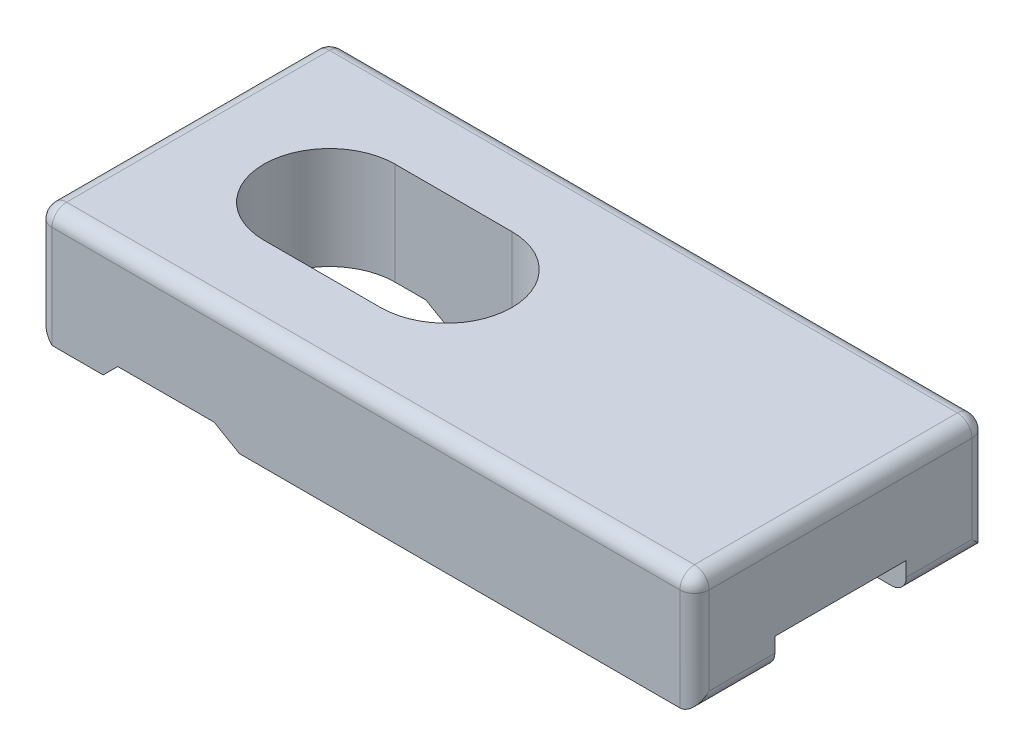
ISO-10303-21;
HEADER;
FILE_DESCRIPTION(('STEP AP214'),'2;1');
FILE_NAME('part.step','',(''),(''),'','','');
FILE_SCHEMA(('AUTOMOTIVE_DESIGN { 1 0 10303 214 1 1 1 1 }'));
ENDSEC;
DATA;
#1=APPLICATION_CONTEXT('core data for automotive mechanical design processes');
#2=APPLICATION_PROTOCOL_DEFINITION('international standard','automotive_design',2000,#1);
#3=PRODUCT_CONTEXT('',#1,'mechanical');
#4=PRODUCT('Part','Part','',(#3));
#5=PRODUCT_RELATED_PRODUCT_CATEGORY('part','',(#4));
#6=PRODUCT_DEFINITION_FORMATION('','',#4);
#7=PRODUCT_DEFINITION_CONTEXT('part definition',#1,'design');
#8=PRODUCT_DEFINITION('design','',#6,#7);
#9=PRODUCT_DEFINITION_SHAPE('','',#8);
#10=(LENGTH_UNIT() NAMED_UNIT(*) SI_UNIT(.MILLI.,.METRE.));
#11=(NAMED_UNIT(*) PLANE_ANGLE_UNIT() SI_UNIT($,.RADIAN.));
#12=(NAMED_UNIT(*) SI_UNIT($,.STERADIAN.) SOLID_ANGLE_UNIT());
#13=UNCERTAINTY_MEASURE_WITH_UNIT(LENGTH_MEASURE(1.E-05),#10,'distance_accuracy_value','');
#14=(GEOMETRIC_REPRESENTATION_CONTEXT(3) GLOBAL_UNCERTAINTY_ASSIGNED_CONTEXT((#13)) GLOBAL_UNIT_ASSIGNED_CONTEXT((#10,
#11,#12)) REPRESENTATION_CONTEXT('',''));
#15=CARTESIAN_POINT('',(0.,0.,0.));
#16=DIRECTION('',(0.,0.,1.));
#17=DIRECTION('',(1.,0.,0.));
#18=AXIS2_PLACEMENT_3D('',#15,#16,#17);
#19=CARTESIAN_POINT('',(0.,0.,0.));
#20=DIRECTION('',(0.,-1.,0.));
#21=DIRECTION('',(0.,0.,-1.));
#22=AXIS2_PLACEMENT_3D('',#19,#20,#21);
#23=PLANE('',#22);
#24=DIRECTION('',(-1.,0.,0.));
#25=VECTOR('',#24,1.);
#26=CARTESIAN_POINT('',(0.,0.,-5.5));
#27=LINE('',#26,#25);
#28=CARTESIAN_POINT('',(4.49999999999999,0.,-5.5));
#29=VERTEX_POINT('',#28);
#30=CARTESIAN_POINT('',(1.00000000000001,0.,-5.5));
#31=VERTEX_POINT('',#30);
#32=EDGE_CURVE('E258',#29,#31,#27,.T.);
#33=ORIENTED_EDGE('',*,*,#32,.F.);
#34=DIRECTION('',(0.,0.,1.));
#35=VECTOR('',#34,1.);
#36=CARTESIAN_POINT('',(4.49999999999999,0.,0.));
#37=LINE('',#36,#35);
#38=CARTESIAN_POINT('',(4.49999999999999,0.,0.));
#39=VERTEX_POINT('',#38);
#40=EDGE_CURVE('E346',#29,#39,#37,.T.);
#41=ORIENTED_EDGE('',*,*,#40,.T.);
#42=DIRECTION('',(1.,0.,0.));
#43=VECTOR('',#42,1.);
#44=CARTESIAN_POINT('',(0.,0.,0.));
#45=LINE('',#44,#43);
#46=CARTESIAN_POINT('',(1.00000000000001,0.,0.));
#47=VERTEX_POINT('',#46);
#48=EDGE_CURVE('E326',#47,#39,#45,.T.);
#49=ORIENTED_EDGE('',*,*,#48,.F.);
#50=DIRECTION('',(0.,0.,-1.));
#51=VECTOR('',#50,1.);
#52=CARTESIAN_POINT('',(1.00000000000001,0.,-5.5));
#53=LINE('',#52,#51);
#54=EDGE_CURVE('E344',#47,#31,#53,.T.);
#55=ORIENTED_EDGE('',*,*,#54,.T.);
#56=EDGE_LOOP('',(#33,#41,#49,#55));
#57=FACE_BOUND('',#56,.T.);
#58=ADVANCED_FACE('F34',(#57),#23,.T.);
#59=DIRECTION('',(-1.,0.,0.));
#60=VECTOR('',#59,1.);
#61=CARTESIAN_POINT('',(0.,0.,-20.));
#62=LINE('',#61,#60);
#63=CARTESIAN_POINT('',(44.,0.,-20.));
#64=VERTEX_POINT('',#63);
#65=CARTESIAN_POINT('',(13.8320508075689,0.,-20.));
#66=VERTEX_POINT('',#65);
#67=EDGE_CURVE('E330',#64,#66,#62,.T.);
#68=ORIENTED_EDGE('',*,*,#67,.F.);
#69=DIRECTION('',(0.,0.,-1.));
#70=VECTOR('',#69,1.);
#71=CARTESIAN_POINT('',(44.,0.,-14.5));
#72=LINE('',#71,#70);
#73=CARTESIAN_POINT('',(44.,0.,-14.5));
#74=VERTEX_POINT('',#73);
#75=EDGE_CURVE('E59',#64,#74,#72,.F.);
#76=ORIENTED_EDGE('',*,*,#75,.T.);
#77=DIRECTION('',(-1.,0.,0.));
#78=VECTOR('',#77,1.);
#79=CARTESIAN_POINT('',(18.,0.,-14.5));
#80=LINE('',#79,#78);
#81=CARTESIAN_POINT('',(13.8320508075689,0.,-14.5));
#82=VERTEX_POINT('',#81);
#83=EDGE_CURVE('E300',#74,#82,#80,.T.);
#84=ORIENTED_EDGE('',*,*,#83,.T.);
#85=DIRECTION('',(0.,0.,-1.));
#86=VECTOR('',#85,1.);
#87=CARTESIAN_POINT('',(13.8320508075689,0.,-20.));
#88=LINE('',#87,#86);
#89=EDGE_CURVE('E353',#82,#66,#88,.T.);
#90=ORIENTED_EDGE('',*,*,#89,.T.);
#91=EDGE_LOOP('',(#68,#76,#84,#90));
#92=FACE_BOUND('',#91,.T.);
#93=ADVANCED_FACE('F554',(#92),#23,.T.);
#94=DIRECTION('',(1.,0.,0.));
#95=VECTOR('',#94,1.);
#96=CARTESIAN_POINT('',(18.,0.,-5.5));
#97=LINE('',#96,#95);
#98=CARTESIAN_POINT('',(13.8320508075689,0.,-5.5));
#99=VERTEX_POINT('',#98);
#100=CARTESIAN_POINT('',(44.,0.,-5.5));
#101=VERTEX_POINT('',#100);
#102=EDGE_CURVE('E304',#99,#101,#97,.T.);
#103=ORIENTED_EDGE('',*,*,#102,.T.);
#104=DIRECTION('',(0.,0.,-1.));
#105=VECTOR('',#104,1.);
#106=CARTESIAN_POINT('',(44.,0.,0.));
#107=LINE('',#106,#105);
#108=CARTESIAN_POINT('',(44.,0.,0.));
#109=VERTEX_POINT('',#108);
#110=EDGE_CURVE('E404',#101,#109,#107,.F.);
#111=ORIENTED_EDGE('',*,*,#110,.T.);
#112=CARTESIAN_POINT('',(13.8320508075689,0.,0.));
#113=VERTEX_POINT('',#112);
#114=EDGE_CURVE('E325',#113,#109,#45,.T.);
#115=ORIENTED_EDGE('',*,*,#114,.F.);
#116=DIRECTION('',(0.,0.,-1.));
#117=VECTOR('',#116,1.);
#118=CARTESIAN_POINT('',(13.8320508075689,0.,-5.5));
#119=LINE('',#118,#117);
#120=EDGE_CURVE('E360',#113,#99,#119,.T.);
#121=ORIENTED_EDGE('',*,*,#120,.T.);
#122=EDGE_LOOP('',(#103,#111,#115,#121));
#123=FACE_BOUND('',#122,.T.);
#124=ADVANCED_FACE('F556',(#123),#23,.T.);
#125=CARTESIAN_POINT('',(9.99999999999999,8.,-10.));
#126=DIRECTION('',(0.,-1.,0.));
#127=DIRECTION('',(0.,0.,-1.));
#128=AXIS2_PLACEMENT_3D('',#125,#126,#127);
#129=CYLINDRICAL_SURFACE('',#128,4.5);
#130=DIRECTION('',(0.,-1.,0.));
#131=VECTOR('',#130,1.);
#132=CARTESIAN_POINT('',(9.99999999999999,8.,-5.5));
#133=LINE('',#132,#131);
#134=CARTESIAN_POINT('',(9.99999999999999,8.,-5.5));
#135=VERTEX_POINT('',#134);
#136=CARTESIAN_POINT('',(9.99999999999999,1.,-5.5));
#137=VERTEX_POINT('',#136);
#138=EDGE_CURVE('E316',#135,#137,#133,.T.);
#139=ORIENTED_EDGE('',*,*,#138,.T.);
#140=CARTESIAN_POINT('',(9.99999999999999,1.,-10.));
#141=DIRECTION('',(0.,-1.,0.));
#142=DIRECTION('',(0.,0.,-1.));
#143=AXIS2_PLACEMENT_3D('',#140,#141,#142);
#144=CIRCLE('',#143,4.5);
#145=CARTESIAN_POINT('',(9.99999999999999,1.,-14.5));
#146=VERTEX_POINT('',#145);
#147=EDGE_CURVE('E278',#137,#146,#144,.T.);
#148=ORIENTED_EDGE('',*,*,#147,.T.);
#149=DIRECTION('',(0.,-1.,0.));
#150=VECTOR('',#149,1.);
#151=CARTESIAN_POINT('',(9.99999999999999,8.,-14.5));
#152=LINE('',#151,#150);
#153=CARTESIAN_POINT('',(9.99999999999999,8.,-14.5));
#154=VERTEX_POINT('',#153);
#155=EDGE_CURVE('E319',#154,#146,#152,.T.);
#156=ORIENTED_EDGE('',*,*,#155,.F.);
#157=CARTESIAN_POINT('',(9.99999999999999,8.,-10.));
#158=DIRECTION('',(0.,1.,0.));
#159=DIRECTION('',(0.,0.,1.));
#160=AXIS2_PLACEMENT_3D('',#157,#158,#159);
#161=CIRCLE('',#160,4.5);
#162=EDGE_CURVE('E306',#154,#135,#161,.T.);
#163=ORIENTED_EDGE('',*,*,#162,.T.);
#164=EDGE_LOOP('',(#139,#148,#156,#163));
#165=FACE_BOUND('',#164,.T.);
#166=ADVANCED_FACE('F478',(#165),#129,.F.);
#167=CARTESIAN_POINT('',(18.,8.,-10.));
#168=DIRECTION('',(0.,-1.,0.));
#169=DIRECTION('',(0.,0.,-1.));
#170=AXIS2_PLACEMENT_3D('',#167,#168,#169);
#171=CYLINDRICAL_SURFACE('',#170,4.5);
#172=DIRECTION('',(0.,-1.,0.));
#173=VECTOR('',#172,1.);
#174=CARTESIAN_POINT('',(18.,8.,-14.5));
#175=LINE('',#174,#173);
#176=CARTESIAN_POINT('',(18.,8.,-14.5));
#177=VERTEX_POINT('',#176);
#178=CARTESIAN_POINT('',(18.,2.,-14.5));
#179=VERTEX_POINT('',#178);
#180=EDGE_CURVE('E322',#177,#179,#175,.T.);
#181=ORIENTED_EDGE('',*,*,#180,.T.);
#182=CARTESIAN_POINT('',(18.,2.,-10.));
#183=DIRECTION('',(0.,-1.,0.));
#184=DIRECTION('',(0.,0.,-1.));
#185=AXIS2_PLACEMENT_3D('',#182,#183,#184);
#186=CIRCLE('',#185,4.5);
#187=CARTESIAN_POINT('',(18.,2.,-5.5));
#188=VERTEX_POINT('',#187);
#189=EDGE_CURVE('E295',#179,#188,#186,.T.);
#190=ORIENTED_EDGE('',*,*,#189,.T.);
#191=DIRECTION('',(0.,-1.,0.));
#192=VECTOR('',#191,1.);
#193=CARTESIAN_POINT('',(18.,8.,-5.5));
#194=LINE('',#193,#192);
#195=CARTESIAN_POINT('',(18.,8.,-5.5));
#196=VERTEX_POINT('',#195);
#197=EDGE_CURVE('E311',#196,#188,#194,.T.);
#198=ORIENTED_EDGE('',*,*,#197,.F.);
#199=CARTESIAN_POINT('',(18.,8.,-10.));
#200=DIRECTION('',(0.,1.,0.));
#201=DIRECTION('',(0.,0.,1.));
#202=AXIS2_PLACEMENT_3D('',#199,#200,#201);
#203=CIRCLE('',#202,4.5);
#204=EDGE_CURVE('E301',#196,#177,#203,.T.);
#205=ORIENTED_EDGE('',*,*,#204,.T.);
#206=EDGE_LOOP('',(#181,#190,#198,#205));
#207=FACE_BOUND('',#206,.T.);
#208=ADVANCED_FACE('F469',(#207),#171,.F.);
#209=CARTESIAN_POINT('',(0.,8.,0.));
#210=DIRECTION('',(0.,-1.,0.));
#211=DIRECTION('',(0.,0.,-1.));
#212=AXIS2_PLACEMENT_3D('',#209,#210,#211);
#213=PLANE('',#212);
#214=DIRECTION('',(-1.,0.,0.));
#215=VECTOR('',#214,1.);
#216=CARTESIAN_POINT('',(0.,8.,-19.));
#217=LINE('',#216,#215);
#218=CARTESIAN_POINT('',(44.,8.,-19.));
#219=VERTEX_POINT('',#218);
#220=CARTESIAN_POINT('',(1.,8.,-19.));
#221=VERTEX_POINT('',#220);
#222=EDGE_CURVE('E368',#219,#221,#217,.T.);
#223=ORIENTED_EDGE('',*,*,#222,.T.);
#224=DIRECTION('',(0.,0.,1.));
#225=VECTOR('',#224,1.);
#226=CARTESIAN_POINT('',(1.,8.,0.));
#227=LINE('',#226,#225);
#228=CARTESIAN_POINT('',(1.,8.,-1.));
#229=VERTEX_POINT('',#228);
#230=EDGE_CURVE('E370',#221,#229,#227,.T.);
#231=ORIENTED_EDGE('',*,*,#230,.T.);
#232=DIRECTION('',(1.,0.,0.));
#233=VECTOR('',#232,1.);
#234=CARTESIAN_POINT('',(0.,8.,-1.));
#235=LINE('',#234,#233);
#236=CARTESIAN_POINT('',(44.,8.,-1.));
#237=VERTEX_POINT('',#236);
#238=EDGE_CURVE('E364',#229,#237,#235,.T.);
#239=ORIENTED_EDGE('',*,*,#238,.T.);
#240=DIRECTION('',(0.,0.,-1.));
#241=VECTOR('',#240,1.);
#242=CARTESIAN_POINT('',(44.,8.,0.));
#243=LINE('',#242,#241);
#244=EDGE_CURVE('E366',#237,#219,#243,.T.);
#245=ORIENTED_EDGE('',*,*,#244,.T.);
#246=EDGE_LOOP('',(#223,#231,#239,#245));
#247=FACE_BOUND('',#246,.T.);
#248=ORIENTED_EDGE('',*,*,#204,.F.);
#249=DIRECTION('',(1.,0.,0.));
#250=VECTOR('',#249,1.);
#251=CARTESIAN_POINT('',(18.,8.,-5.5));
#252=LINE('',#251,#250);
#253=EDGE_CURVE('E309',#135,#196,#252,.T.);
#254=ORIENTED_EDGE('',*,*,#253,.F.);
#255=ORIENTED_EDGE('',*,*,#162,.F.);
#256=DIRECTION('',(-1.,0.,0.));
#257=VECTOR('',#256,1.);
#258=CARTESIAN_POINT('',(18.,8.,-14.5));
#259=LINE('',#258,#257);
#260=EDGE_CURVE('E303',#177,#154,#259,.T.);
#261=ORIENTED_EDGE('',*,*,#260,.F.);
#262=EDGE_LOOP('',(#248,#254,#255,#261));
#263=FACE_BOUND('',#262,.T.);
#264=ADVANCED_FACE('F474',(#247,#263),#213,.F.);
#265=CARTESIAN_POINT('',(4.49999999999999,0.,-20.));
#266=VERTEX_POINT('',#265);
#267=CARTESIAN_POINT('',(1.00000000000001,0.,-20.));
#268=VERTEX_POINT('',#267);
#269=EDGE_CURVE('E329',#266,#268,#62,.T.);
#270=ORIENTED_EDGE('',*,*,#269,.F.);
#271=DIRECTION('',(0.,0.,1.));
#272=VECTOR('',#271,1.);
#273=CARTESIAN_POINT('',(4.49999999999999,0.,-14.5));
#274=LINE('',#273,#272);
#275=CARTESIAN_POINT('',(4.49999999999999,0.,-14.5));
#276=VERTEX_POINT('',#275);
#277=EDGE_CURVE('E242',#266,#276,#274,.T.);
#278=ORIENTED_EDGE('',*,*,#277,.T.);
#279=DIRECTION('',(1.,0.,0.));
#280=VECTOR('',#279,1.);
#281=CARTESIAN_POINT('',(0.,0.,-14.5));
#282=LINE('',#281,#280);
#283=CARTESIAN_POINT('',(1.00000000000001,0.,-14.5));
#284=VERTEX_POINT('',#283);
#285=EDGE_CURVE('E261',#284,#276,#282,.T.);
#286=ORIENTED_EDGE('',*,*,#285,.F.);
#287=DIRECTION('',(0.,0.,-1.));
#288=VECTOR('',#287,1.);
#289=CARTESIAN_POINT('',(1.00000000000001,0.,-20.));
#290=LINE('',#289,#288);
#291=EDGE_CURVE('E237',#284,#268,#290,.T.);
#292=ORIENTED_EDGE('',*,*,#291,.T.);
#293=EDGE_LOOP('',(#270,#278,#286,#292));
#294=FACE_BOUND('',#293,.T.);
#295=ADVANCED_FACE('F542',(#294),#23,.T.);
#296=CARTESIAN_POINT('',(0.,8.,0.));
#297=DIRECTION('',(1.,0.,0.));
#298=DIRECTION('',(0.,0.,-1.));
#299=AXIS2_PLACEMENT_3D('',#296,#297,#298);
#300=PLANE('',#299);
#301=DIRECTION('',(0.,0.,1.));
#302=VECTOR('',#301,1.);
#303=CARTESIAN_POINT('',(0.,7.,0.));
#304=LINE('',#303,#302);
#305=CARTESIAN_POINT('',(0.,7.,-1.));
#306=VERTEX_POINT('',#305);
#307=CARTESIAN_POINT('',(0.,7.,-19.));
#308=VERTEX_POINT('',#307);
#309=EDGE_CURVE('E375',#306,#308,#304,.F.);
#310=ORIENTED_EDGE('',*,*,#309,.T.);
#311=DIRECTION('',(0.,-1.,0.));
#312=VECTOR('',#311,1.);
#313=CARTESIAN_POINT('',(0.,8.,-19.));
#314=LINE('',#313,#312);
#315=CARTESIAN_POINT('',(0.,1.,-19.));
#316=VERTEX_POINT('',#315);
#317=EDGE_CURVE('E226',#308,#316,#314,.T.);
#318=ORIENTED_EDGE('',*,*,#317,.T.);
#319=DIRECTION('',(0.,0.,1.));
#320=VECTOR('',#319,1.);
#321=CARTESIAN_POINT('',(0.,1.,-14.5));
#322=LINE('',#321,#320);
#323=CARTESIAN_POINT('',(0.,1.,-14.5));
#324=VERTEX_POINT('',#323);
#325=EDGE_CURVE('E217',#316,#324,#322,.T.);
#326=ORIENTED_EDGE('',*,*,#325,.T.);
#327=DIRECTION('',(0.,0.,-1.));
#328=VECTOR('',#327,1.);
#329=CARTESIAN_POINT('',(0.,1.,-5.5));
#330=LINE('',#329,#328);
#331=CARTESIAN_POINT('',(0.,1.,-5.5));
#332=VERTEX_POINT('',#331);
#333=EDGE_CURVE('E223',#332,#324,#330,.T.);
#334=ORIENTED_EDGE('',*,*,#333,.F.);
#335=DIRECTION('',(0.,0.,1.));
#336=VECTOR('',#335,1.);
#337=CARTESIAN_POINT('',(0.,1.,0.));
#338=LINE('',#337,#336);
#339=CARTESIAN_POINT('',(0.,1.,-1.));
#340=VERTEX_POINT('',#339);
#341=EDGE_CURVE('E229',#332,#340,#338,.T.);
#342=ORIENTED_EDGE('',*,*,#341,.T.);
#343=DIRECTION('',(0.,-1.,0.));
#344=VECTOR('',#343,1.);
#345=CARTESIAN_POINT('',(0.,8.,-1.));
#346=LINE('',#345,#344);
#347=EDGE_CURVE('E373',#340,#306,#346,.F.);
#348=ORIENTED_EDGE('',*,*,#347,.T.);
#349=EDGE_LOOP('',(#310,#318,#326,#334,#342,#348));
#350=FACE_BOUND('',#349,.T.);
#351=ADVANCED_FACE('F220',(#350),#300,.F.);
#352=CARTESIAN_POINT('',(0.,8.,0.));
#353=DIRECTION('',(0.,0.,-1.));
#354=DIRECTION('',(-1.,0.,0.));
#355=AXIS2_PLACEMENT_3D('',#352,#353,#354);
#356=PLANE('',#355);
#357=ORIENTED_EDGE('',*,*,#114,.T.);
#358=DIRECTION('',(0.,-1.,0.));
#359=VECTOR('',#358,1.);
#360=CARTESIAN_POINT('',(44.,8.,0.));
#361=LINE('',#360,#359);
#362=CARTESIAN_POINT('',(44.,7.,0.));
#363=VERTEX_POINT('',#362);
#364=EDGE_CURVE('E398',#109,#363,#361,.F.);
#365=ORIENTED_EDGE('',*,*,#364,.T.);
#366=DIRECTION('',(1.,0.,0.));
#367=VECTOR('',#366,1.);
#368=CARTESIAN_POINT('',(0.,7.,0.));
#369=LINE('',#368,#367);
#370=CARTESIAN_POINT('',(1.,7.,0.));
#371=VERTEX_POINT('',#370);
#372=EDGE_CURVE('E396',#363,#371,#369,.F.);
#373=ORIENTED_EDGE('',*,*,#372,.T.);
#374=DIRECTION('',(0.,-1.,0.));
#375=VECTOR('',#374,1.);
#376=CARTESIAN_POINT('',(1.,8.,0.));
#377=LINE('',#376,#375);
#378=EDGE_CURVE('E394',#371,#47,#377,.T.);
#379=ORIENTED_EDGE('',*,*,#378,.T.);
#380=ORIENTED_EDGE('',*,*,#48,.T.);
#381=DIRECTION('',(0.70710678118655,0.707106781186545,0.));
#382=VECTOR('',#381,1.);
#383=CARTESIAN_POINT('',(5.5,1.,0.));
#384=LINE('',#383,#382);
#385=CARTESIAN_POINT('',(5.5,1.,0.));
#386=VERTEX_POINT('',#385);
#387=EDGE_CURVE('E230',#39,#386,#384,.T.);
#388=ORIENTED_EDGE('',*,*,#387,.T.);
#389=DIRECTION('',(-1.,0.,0.));
#390=VECTOR('',#389,1.);
#391=CARTESIAN_POINT('',(5.5,1.,0.));
#392=LINE('',#391,#390);
#393=CARTESIAN_POINT('',(12.1,1.,0.));
#394=VERTEX_POINT('',#393);
#395=EDGE_CURVE('E272',#394,#386,#392,.T.);
#396=ORIENTED_EDGE('',*,*,#395,.F.);
#397=DIRECTION('',(0.866025403784438,-0.500000000000002,0.));
#398=VECTOR('',#397,1.);
#399=CARTESIAN_POINT('',(12.1,1.,0.));
#400=LINE('',#399,#398);
#401=EDGE_CURVE('E358',#394,#113,#400,.T.);
#402=ORIENTED_EDGE('',*,*,#401,.T.);
#403=EDGE_LOOP('',(#357,#365,#373,#379,#380,#388,#396,#402));
#404=FACE_BOUND('',#403,.T.);
#405=ADVANCED_FACE('F491',(#404),#356,.F.);
#406=CARTESIAN_POINT('',(45.,8.,0.));
#407=DIRECTION('',(-1.,0.,0.));
#408=DIRECTION('',(0.,0.,1.));
#409=AXIS2_PLACEMENT_3D('',#406,#407,#408);
#410=PLANE('',#409);
#411=DIRECTION('',(0.,-1.,0.));
#412=VECTOR('',#411,1.);
#413=CARTESIAN_POINT('',(45.,8.,-1.));
#414=LINE('',#413,#412);
#415=CARTESIAN_POINT('',(45.,7.,-1.));
#416=VERTEX_POINT('',#415);
#417=CARTESIAN_POINT('',(45.,1.,-1.));
#418=VERTEX_POINT('',#417);
#419=EDGE_CURVE('E390',#416,#418,#414,.T.);
#420=ORIENTED_EDGE('',*,*,#419,.T.);
#421=DIRECTION('',(0.,0.,-1.));
#422=VECTOR('',#421,1.);
#423=CARTESIAN_POINT('',(45.,1.,-5.5));
#424=LINE('',#423,#422);
#425=CARTESIAN_POINT('',(45.,1.,-5.5));
#426=VERTEX_POINT('',#425);
#427=EDGE_CURVE('E392',#418,#426,#424,.T.);
#428=ORIENTED_EDGE('',*,*,#427,.T.);
#429=DIRECTION('',(0.,-1.,0.));
#430=VECTOR('',#429,1.);
#431=CARTESIAN_POINT('',(45.,2.,-5.5));
#432=LINE('',#431,#430);
#433=CARTESIAN_POINT('',(45.,2.,-5.5));
#434=VERTEX_POINT('',#433);
#435=EDGE_CURVE('E293',#434,#426,#432,.T.);
#436=ORIENTED_EDGE('',*,*,#435,.F.);
#437=DIRECTION('',(0.,0.,1.));
#438=VECTOR('',#437,1.);
#439=CARTESIAN_POINT('',(45.,2.,-5.5));
#440=LINE('',#439,#438);
#441=CARTESIAN_POINT('',(45.,2.,-14.5));
#442=VERTEX_POINT('',#441);
#443=EDGE_CURVE('E289',#442,#434,#440,.T.);
#444=ORIENTED_EDGE('',*,*,#443,.F.);
#445=DIRECTION('',(0.,-1.,0.));
#446=VECTOR('',#445,1.);
#447=CARTESIAN_POINT('',(45.,2.,-14.5));
#448=LINE('',#447,#446);
#449=CARTESIAN_POINT('',(45.,1.,-14.5));
#450=VERTEX_POINT('',#449);
#451=EDGE_CURVE('E292',#442,#450,#448,.T.);
#452=ORIENTED_EDGE('',*,*,#451,.T.);
#453=DIRECTION('',(0.,0.,-1.));
#454=VECTOR('',#453,1.);
#455=CARTESIAN_POINT('',(45.,1.,-20.));
#456=LINE('',#455,#454);
#457=CARTESIAN_POINT('',(45.,1.,-19.));
#458=VERTEX_POINT('',#457);
#459=EDGE_CURVE('E386',#450,#458,#456,.T.);
#460=ORIENTED_EDGE('',*,*,#459,.T.);
#461=DIRECTION('',(0.,-1.,0.));
#462=VECTOR('',#461,1.);
#463=CARTESIAN_POINT('',(45.,8.,-19.));
#464=LINE('',#463,#462);
#465=CARTESIAN_POINT('',(45.,7.,-19.));
#466=VERTEX_POINT('',#465);
#467=EDGE_CURVE('E384',#458,#466,#464,.F.);
#468=ORIENTED_EDGE('',*,*,#467,.T.);
#469=DIRECTION('',(0.,0.,-1.));
#470=VECTOR('',#469,1.);
#471=CARTESIAN_POINT('',(45.,7.,0.));
#472=LINE('',#471,#470);
#473=EDGE_CURVE('E388',#466,#416,#472,.F.);
#474=ORIENTED_EDGE('',*,*,#473,.T.);
#475=EDGE_LOOP('',(#420,#428,#436,#444,#452,#460,#468,#474));
#476=FACE_BOUND('',#475,.T.);
#477=ADVANCED_FACE('F462',(#476),#410,.F.);
#478=CARTESIAN_POINT('',(0.,8.,-20.));
#479=DIRECTION('',(0.,0.,1.));
#480=DIRECTION('',(1.,0.,0.));
#481=AXIS2_PLACEMENT_3D('',#478,#479,#480);
#482=PLANE('',#481);
#483=DIRECTION('',(-1.,0.,0.));
#484=VECTOR('',#483,1.);
#485=CARTESIAN_POINT('',(0.,7.,-20.));
#486=LINE('',#485,#484);
#487=CARTESIAN_POINT('',(1.,7.,-20.));
#488=VERTEX_POINT('',#487);
#489=CARTESIAN_POINT('',(44.,7.,-20.));
#490=VERTEX_POINT('',#489);
#491=EDGE_CURVE('E380',#488,#490,#486,.F.);
#492=ORIENTED_EDGE('',*,*,#491,.T.);
#493=DIRECTION('',(0.,-1.,0.));
#494=VECTOR('',#493,1.);
#495=CARTESIAN_POINT('',(44.,8.,-20.));
#496=LINE('',#495,#494);
#497=EDGE_CURVE('E382',#490,#64,#496,.T.);
#498=ORIENTED_EDGE('',*,*,#497,.T.);
#499=ORIENTED_EDGE('',*,*,#67,.T.);
#500=DIRECTION('',(-0.866025403784437,0.500000000000003,0.));
#501=VECTOR('',#500,1.);
#502=CARTESIAN_POINT('',(12.1,1.00000000000001,-20.));
#503=LINE('',#502,#501);
#504=CARTESIAN_POINT('',(12.1,1.,-20.));
#505=VERTEX_POINT('',#504);
#506=EDGE_CURVE('E356',#66,#505,#503,.T.);
#507=ORIENTED_EDGE('',*,*,#506,.T.);
#508=DIRECTION('',(1.,0.,0.));
#509=VECTOR('',#508,1.);
#510=CARTESIAN_POINT('',(5.5,1.,-20.));
#511=LINE('',#510,#509);
#512=CARTESIAN_POINT('',(5.5,1.,-20.));
#513=VERTEX_POINT('',#512);
#514=EDGE_CURVE('E265',#513,#505,#511,.T.);
#515=ORIENTED_EDGE('',*,*,#514,.F.);
#516=DIRECTION('',(-0.70710678118655,-0.707106781186545,0.));
#517=VECTOR('',#516,1.);
#518=CARTESIAN_POINT('',(5.5,1.,-20.));
#519=LINE('',#518,#517);
#520=EDGE_CURVE('E335',#513,#266,#519,.T.);
#521=ORIENTED_EDGE('',*,*,#520,.T.);
#522=ORIENTED_EDGE('',*,*,#269,.T.);
#523=DIRECTION('',(0.,-1.,0.));
#524=VECTOR('',#523,1.);
#525=CARTESIAN_POINT('',(1.,8.,-20.));
#526=LINE('',#525,#524);
#527=EDGE_CURVE('E378',#268,#488,#526,.F.);
#528=ORIENTED_EDGE('',*,*,#527,.T.);
#529=EDGE_LOOP('',(#492,#498,#499,#507,#515,#521,#522,#528));
#530=FACE_BOUND('',#529,.T.);
#531=ADVANCED_FACE('F545',(#530),#482,.F.);
#532=CARTESIAN_POINT('',(18.,8.,-14.5));
#533=DIRECTION('',(0.,0.,1.));
#534=DIRECTION('',(1.,0.,0.));
#535=AXIS2_PLACEMENT_3D('',#532,#533,#534);
#536=PLANE('',#535);
#537=ORIENTED_EDGE('',*,*,#83,.F.);
#538=CARTESIAN_POINT('',(44.,1.,-14.5));
#539=DIRECTION('',(0.,0.,1.));
#540=DIRECTION('',(1.,0.,0.));
#541=AXIS2_PLACEMENT_3D('',#538,#539,#540);
#542=CIRCLE('',#541,1.);
#543=EDGE_CURVE('E401',#74,#450,#542,.T.);
#544=ORIENTED_EDGE('',*,*,#543,.T.);
#545=ORIENTED_EDGE('',*,*,#451,.F.);
#546=DIRECTION('',(1.,0.,0.));
#547=VECTOR('',#546,1.);
#548=CARTESIAN_POINT('',(45.,2.,-14.5));
#549=LINE('',#548,#547);
#550=EDGE_CURVE('E287',#179,#442,#549,.T.);
#551=ORIENTED_EDGE('',*,*,#550,.F.);
#552=ORIENTED_EDGE('',*,*,#180,.F.);
#553=ORIENTED_EDGE('',*,*,#260,.T.);
#554=ORIENTED_EDGE('',*,*,#155,.T.);
#555=DIRECTION('',(1.,0.,0.));
#556=VECTOR('',#555,1.);
#557=CARTESIAN_POINT('',(18.,1.,-14.5));
#558=LINE('',#557,#556);
#559=CARTESIAN_POINT('',(12.1,1.,-14.5));
#560=VERTEX_POINT('',#559);
#561=EDGE_CURVE('E282',#146,#560,#558,.T.);
#562=ORIENTED_EDGE('',*,*,#561,.T.);
#563=DIRECTION('',(0.866025403784437,-0.500000000000003,0.));
#564=VECTOR('',#563,1.);
#565=CARTESIAN_POINT('',(13.4939110867544,0.195225058835923,-14.5));
#566=LINE('',#565,#564);
#567=EDGE_CURVE('E350',#560,#82,#566,.T.);
#568=ORIENTED_EDGE('',*,*,#567,.T.);
#569=EDGE_LOOP('',(#537,#544,#545,#551,#552,#553,#554,#562,#568));
#570=FACE_BOUND('',#569,.T.);
#571=ADVANCED_FACE('F458',(#570),#536,.T.);
#572=CARTESIAN_POINT('',(18.,8.,-5.5));
#573=DIRECTION('',(0.,0.,-1.));
#574=DIRECTION('',(-1.,0.,0.));
#575=AXIS2_PLACEMENT_3D('',#572,#573,#574);
#576=PLANE('',#575);
#577=ORIENTED_EDGE('',*,*,#435,.T.);
#578=CARTESIAN_POINT('',(44.,1.,-5.5));
#579=DIRECTION('',(0.,0.,-1.));
#580=DIRECTION('',(-1.,0.,0.));
#581=AXIS2_PLACEMENT_3D('',#578,#579,#580);
#582=CIRCLE('',#581,1.);
#583=EDGE_CURVE('E51',#426,#101,#582,.T.);
#584=ORIENTED_EDGE('',*,*,#583,.T.);
#585=ORIENTED_EDGE('',*,*,#102,.F.);
#586=DIRECTION('',(-0.866025403784438,0.500000000000002,0.));
#587=VECTOR('',#586,1.);
#588=CARTESIAN_POINT('',(13.4939110867544,0.195225058835913,-5.5));
#589=LINE('',#588,#587);
#590=CARTESIAN_POINT('',(12.1,1.,-5.5));
#591=VERTEX_POINT('',#590);
#592=EDGE_CURVE('E362',#99,#591,#589,.T.);
#593=ORIENTED_EDGE('',*,*,#592,.T.);
#594=DIRECTION('',(-1.,0.,0.));
#595=VECTOR('',#594,1.);
#596=CARTESIAN_POINT('',(18.,1.,-5.5));
#597=LINE('',#596,#595);
#598=EDGE_CURVE('E332',#591,#137,#597,.T.);
#599=ORIENTED_EDGE('',*,*,#598,.T.);
#600=ORIENTED_EDGE('',*,*,#138,.F.);
#601=ORIENTED_EDGE('',*,*,#253,.T.);
#602=ORIENTED_EDGE('',*,*,#197,.T.);
#603=DIRECTION('',(-1.,0.,0.));
#604=VECTOR('',#603,1.);
#605=CARTESIAN_POINT('',(9.99999999999999,2.,-5.5));
#606=LINE('',#605,#604);
#607=EDGE_CURVE('E285',#434,#188,#606,.T.);
#608=ORIENTED_EDGE('',*,*,#607,.F.);
#609=EDGE_LOOP('',(#577,#584,#585,#593,#599,#600,#601,#602,#608));
#610=FACE_BOUND('',#609,.T.);
#611=ADVANCED_FACE('F482',(#610),#576,.T.);
#612=CARTESIAN_POINT('',(9.99999999999999,2.,-10.));
#613=DIRECTION('',(0.,-1.,0.));
#614=DIRECTION('',(0.,0.,-1.));
#615=AXIS2_PLACEMENT_3D('',#612,#613,#614);
#616=PLANE('',#615);
#617=ORIENTED_EDGE('',*,*,#550,.T.);
#618=ORIENTED_EDGE('',*,*,#443,.T.);
#619=ORIENTED_EDGE('',*,*,#607,.T.);
#620=ORIENTED_EDGE('',*,*,#189,.F.);
#621=EDGE_LOOP('',(#617,#618,#619,#620));
#622=FACE_BOUND('',#621,.T.);
#623=ADVANCED_FACE('F465',(#622),#616,.T.);
#624=CARTESIAN_POINT('',(0.,1.,-5.5));
#625=DIRECTION('',(0.,0.,1.));
#626=DIRECTION('',(1.,0.,0.));
#627=AXIS2_PLACEMENT_3D('',#624,#625,#626);
#628=PLANE('',#627);
#629=DIRECTION('',(-1.,0.,0.));
#630=VECTOR('',#629,1.);
#631=CARTESIAN_POINT('',(0.,1.,-5.5));
#632=LINE('',#631,#630);
#633=CARTESIAN_POINT('',(5.5,1.,-5.5));
#634=VERTEX_POINT('',#633);
#635=EDGE_CURVE('E257',#634,#332,#632,.T.);
#636=ORIENTED_EDGE('',*,*,#635,.F.);
#637=DIRECTION('',(-0.70710678118655,-0.707106781186545,0.));
#638=VECTOR('',#637,1.);
#639=CARTESIAN_POINT('',(5.5,1.,-5.5));
#640=LINE('',#639,#638);
#641=EDGE_CURVE('E342',#634,#29,#640,.T.);
#642=ORIENTED_EDGE('',*,*,#641,.T.);
#643=ORIENTED_EDGE('',*,*,#32,.T.);
#644=DIRECTION('',(-0.70710678118655,0.707106781186545,0.));
#645=VECTOR('',#644,1.);
#646=CARTESIAN_POINT('',(0.,1.,-5.5));
#647=LINE('',#646,#645);
#648=EDGE_CURVE('E340',#31,#332,#647,.T.);
#649=ORIENTED_EDGE('',*,*,#648,.T.);
#650=EDGE_LOOP('',(#636,#642,#643,#649));
#651=FACE_BOUND('',#650,.T.);
#652=ADVANCED_FACE('F499',(#651),#628,.F.);
#653=CARTESIAN_POINT('',(0.,1.,-14.5));
#654=DIRECTION('',(0.,0.,-1.));
#655=DIRECTION('',(-1.,0.,0.));
#656=AXIS2_PLACEMENT_3D('',#653,#654,#655);
#657=PLANE('',#656);
#658=ORIENTED_EDGE('',*,*,#285,.T.);
#659=DIRECTION('',(0.70710678118655,0.707106781186545,0.));
#660=VECTOR('',#659,1.);
#661=CARTESIAN_POINT('',(5.5,1.,-14.5));
#662=LINE('',#661,#660);
#663=CARTESIAN_POINT('',(5.5,1.,-14.5));
#664=VERTEX_POINT('',#663);
#665=EDGE_CURVE('E241',#276,#664,#662,.T.);
#666=ORIENTED_EDGE('',*,*,#665,.T.);
#667=DIRECTION('',(1.,0.,0.));
#668=VECTOR('',#667,1.);
#669=CARTESIAN_POINT('',(0.,1.,-14.5));
#670=LINE('',#669,#668);
#671=EDGE_CURVE('E245',#324,#664,#670,.T.);
#672=ORIENTED_EDGE('',*,*,#671,.F.);
#673=DIRECTION('',(0.70710678118655,-0.707106781186545,0.));
#674=VECTOR('',#673,1.);
#675=CARTESIAN_POINT('',(0.,1.,-14.5));
#676=LINE('',#675,#674);
#677=EDGE_CURVE('E233',#324,#284,#676,.T.);
#678=ORIENTED_EDGE('',*,*,#677,.T.);
#679=EDGE_LOOP('',(#658,#666,#672,#678));
#680=FACE_BOUND('',#679,.T.);
#681=ADVANCED_FACE('F246',(#680),#657,.F.);
#682=CARTESIAN_POINT('',(0.,1.,0.));
#683=DIRECTION('',(0.,-1.,0.));
#684=DIRECTION('',(0.,0.,-1.));
#685=AXIS2_PLACEMENT_3D('',#682,#683,#684);
#686=PLANE('',#685);
#687=ORIENTED_EDGE('',*,*,#147,.F.);
#688=ORIENTED_EDGE('',*,*,#598,.F.);
#689=DIRECTION('',(0.,0.,1.));
#690=VECTOR('',#689,1.);
#691=CARTESIAN_POINT('',(12.1,1.,0.));
#692=LINE('',#691,#690);
#693=EDGE_CURVE('E268',#591,#394,#692,.T.);
#694=ORIENTED_EDGE('',*,*,#693,.T.);
#695=ORIENTED_EDGE('',*,*,#395,.T.);
#696=DIRECTION('',(0.,0.,-1.));
#697=VECTOR('',#696,1.);
#698=CARTESIAN_POINT('',(5.5,1.,0.));
#699=LINE('',#698,#697);
#700=EDGE_CURVE('E275',#386,#634,#699,.T.);
#701=ORIENTED_EDGE('',*,*,#700,.T.);
#702=ORIENTED_EDGE('',*,*,#635,.T.);
#703=ORIENTED_EDGE('',*,*,#333,.T.);
#704=ORIENTED_EDGE('',*,*,#671,.T.);
#705=DIRECTION('',(0.,0.,-1.));
#706=VECTOR('',#705,1.);
#707=CARTESIAN_POINT('',(5.5,1.,-14.5));
#708=LINE('',#707,#706);
#709=EDGE_CURVE('E251',#664,#513,#708,.T.);
#710=ORIENTED_EDGE('',*,*,#709,.T.);
#711=ORIENTED_EDGE('',*,*,#514,.T.);
#712=EDGE_CURVE('E269',#505,#560,#692,.T.);
#713=ORIENTED_EDGE('',*,*,#712,.T.);
#714=ORIENTED_EDGE('',*,*,#561,.F.);
#715=EDGE_LOOP('',(#687,#688,#694,#695,#701,#702,#703,#704,#710,#711,#713,#714));
#716=FACE_BOUND('',#715,.T.);
#717=ADVANCED_FACE('F254',(#716),#686,.T.);
#718=CARTESIAN_POINT('',(5.5,1.,-14.5));
#719=DIRECTION('',(0.707106781186545,-0.70710678118655,0.));
#720=DIRECTION('',(0.,0.,1.));
#721=AXIS2_PLACEMENT_3D('',#718,#719,#720);
#722=PLANE('',#721);
#723=ORIENTED_EDGE('',*,*,#665,.F.);
#724=ORIENTED_EDGE('',*,*,#277,.F.);
#725=ORIENTED_EDGE('',*,*,#520,.F.);
#726=ORIENTED_EDGE('',*,*,#709,.F.);
#727=EDGE_LOOP('',(#723,#724,#725,#726));
#728=FACE_BOUND('',#727,.T.);
#729=ADVANCED_FACE('F548',(#728),#722,.T.);
#730=CARTESIAN_POINT('',(5.5,1.,0.));
#731=DIRECTION('',(0.707106781186545,-0.70710678118655,0.));
#732=DIRECTION('',(0.,0.,1.));
#733=AXIS2_PLACEMENT_3D('',#730,#731,#732);
#734=PLANE('',#733);
#735=ORIENTED_EDGE('',*,*,#387,.F.);
#736=ORIENTED_EDGE('',*,*,#40,.F.);
#737=ORIENTED_EDGE('',*,*,#641,.F.);
#738=ORIENTED_EDGE('',*,*,#700,.F.);
#739=EDGE_LOOP('',(#735,#736,#737,#738));
#740=FACE_BOUND('',#739,.T.);
#741=ADVANCED_FACE('F497',(#740),#734,.T.);
#742=CARTESIAN_POINT('',(0.,1.,0.));
#743=DIRECTION('',(-0.707106781186545,-0.70710678118655,0.));
#744=DIRECTION('',(0.,0.,-1.));
#745=AXIS2_PLACEMENT_3D('',#742,#743,#744);
#746=PLANE('',#745);
#747=ORIENTED_EDGE('',*,*,#54,.F.);
#748=CARTESIAN_POINT('',(1.,0.,-1.));
#749=DIRECTION('',(-0.707106781186545,-0.70710678118655,0.));
#750=DIRECTION('',(0.70710678118655,-0.707106781186545,0.));
#751=AXIS2_PLACEMENT_3D('',#748,#749,#750);
#752=ELLIPSE('',#751,1.41421356237309,1.);
#753=EDGE_CURVE('E11',#47,#340,#752,.T.);
#754=ORIENTED_EDGE('',*,*,#753,.T.);
#755=ORIENTED_EDGE('',*,*,#341,.F.);
#756=ORIENTED_EDGE('',*,*,#648,.F.);
#757=EDGE_LOOP('',(#747,#754,#755,#756));
#758=FACE_BOUND('',#757,.T.);
#759=ADVANCED_FACE('F504',(#758),#746,.T.);
#760=CARTESIAN_POINT('',(0.,1.,0.));
#761=DIRECTION('',(-0.707106781186545,-0.70710678118655,0.));
#762=DIRECTION('',(0.,0.,-1.));
#763=AXIS2_PLACEMENT_3D('',#760,#761,#762);
#764=PLANE('',#763);
#765=ORIENTED_EDGE('',*,*,#325,.F.);
#766=CARTESIAN_POINT('',(1.,0.,-19.));
#767=DIRECTION('',(-0.707106781186545,-0.70710678118655,0.));
#768=DIRECTION('',(0.70710678118655,-0.707106781186545,0.));
#769=AXIS2_PLACEMENT_3D('',#766,#767,#768);
#770=ELLIPSE('',#769,1.41421356237309,1.);
#771=EDGE_CURVE('E43',#316,#268,#770,.T.);
#772=ORIENTED_EDGE('',*,*,#771,.T.);
#773=ORIENTED_EDGE('',*,*,#291,.F.);
#774=ORIENTED_EDGE('',*,*,#677,.F.);
#775=EDGE_LOOP('',(#765,#772,#773,#774));
#776=FACE_BOUND('',#775,.T.);
#777=ADVANCED_FACE('F235',(#776),#764,.T.);
#778=CARTESIAN_POINT('',(12.1,1.00000000000001,0.));
#779=DIRECTION('',(-0.500000000000003,-0.866025403784437,0.));
#780=DIRECTION('',(0.,0.,-1.));
#781=AXIS2_PLACEMENT_3D('',#778,#779,#780);
#782=PLANE('',#781);
#783=ORIENTED_EDGE('',*,*,#506,.F.);
#784=ORIENTED_EDGE('',*,*,#89,.F.);
#785=ORIENTED_EDGE('',*,*,#567,.F.);
#786=ORIENTED_EDGE('',*,*,#712,.F.);
#787=EDGE_LOOP('',(#783,#784,#785,#786));
#788=FACE_BOUND('',#787,.T.);
#789=ADVANCED_FACE('F552',(#788),#782,.T.);
#790=CARTESIAN_POINT('',(12.1,1.,0.));
#791=DIRECTION('',(-0.500000000000002,-0.866025403784438,0.));
#792=DIRECTION('',(0.,0.,-1.));
#793=AXIS2_PLACEMENT_3D('',#790,#791,#792);
#794=PLANE('',#793);
#795=ORIENTED_EDGE('',*,*,#592,.F.);
#796=ORIENTED_EDGE('',*,*,#120,.F.);
#797=ORIENTED_EDGE('',*,*,#401,.F.);
#798=ORIENTED_EDGE('',*,*,#693,.F.);
#799=EDGE_LOOP('',(#795,#796,#797,#798));
#800=FACE_BOUND('',#799,.T.);
#801=ADVANCED_FACE('F486',(#800),#794,.T.);
#802=CARTESIAN_POINT('',(44.,1.,0.));
#803=DIRECTION('',(0.,0.,1.));
#804=DIRECTION('',(1.,0.,0.));
#805=AXIS2_PLACEMENT_3D('',#802,#803,#804);
#806=CYLINDRICAL_SURFACE('',#805,1.);
#807=ORIENTED_EDGE('',*,*,#543,.F.);
#808=ORIENTED_EDGE('',*,*,#75,.F.);
#809=CARTESIAN_POINT('',(44.,1.,-19.));
#810=DIRECTION('',(0.,-0.707106781186547,0.707106781186547));
#811=DIRECTION('',(0.,-0.707106781186547,-0.707106781186547));
#812=AXIS2_PLACEMENT_3D('',#809,#810,#811);
#813=ELLIPSE('',#812,1.41421356237309,1.);
#814=EDGE_CURVE('E38',#458,#64,#813,.F.);
#815=ORIENTED_EDGE('',*,*,#814,.F.);
#816=ORIENTED_EDGE('',*,*,#459,.F.);
#817=EDGE_LOOP('',(#807,#808,#815,#816));
#818=FACE_BOUND('',#817,.T.);
#819=ADVANCED_FACE('F36',(#818),#806,.T.);
#820=CARTESIAN_POINT('',(44.,1.,0.));
#821=DIRECTION('',(0.,0.,1.));
#822=DIRECTION('',(1.,0.,0.));
#823=AXIS2_PLACEMENT_3D('',#820,#821,#822);
#824=CYLINDRICAL_SURFACE('',#823,1.);
#825=ORIENTED_EDGE('',*,*,#583,.F.);
#826=ORIENTED_EDGE('',*,*,#427,.F.);
#827=CARTESIAN_POINT('',(44.,1.,-1.));
#828=DIRECTION('',(0.,-0.707106781186547,-0.707106781186547));
#829=DIRECTION('',(0.,-0.707106781186547,0.707106781186547));
#830=AXIS2_PLACEMENT_3D('',#827,#828,#829);
#831=ELLIPSE('',#830,1.41421356237309,1.);
#832=EDGE_CURVE('E440',#109,#418,#831,.F.);
#833=ORIENTED_EDGE('',*,*,#832,.F.);
#834=ORIENTED_EDGE('',*,*,#110,.F.);
#835=EDGE_LOOP('',(#825,#826,#833,#834));
#836=FACE_BOUND('',#835,.T.);
#837=ADVANCED_FACE('F618',(#836),#824,.T.);
#838=CARTESIAN_POINT('',(44.,8.,-19.));
#839=DIRECTION('',(0.,-1.,0.));
#840=DIRECTION('',(0.,0.,-1.));
#841=AXIS2_PLACEMENT_3D('',#838,#839,#840);
#842=CYLINDRICAL_SURFACE('',#841,1.);
#843=ORIENTED_EDGE('',*,*,#814,.T.);
#844=ORIENTED_EDGE('',*,*,#497,.F.);
#845=CARTESIAN_POINT('',(44.,7.,-19.));
#846=DIRECTION('',(0.,1.,0.));
#847=DIRECTION('',(0.,0.,1.));
#848=AXIS2_PLACEMENT_3D('',#845,#846,#847);
#849=CIRCLE('',#848,1.);
#850=EDGE_CURVE('E438',#466,#490,#849,.T.);
#851=ORIENTED_EDGE('',*,*,#850,.F.);
#852=ORIENTED_EDGE('',*,*,#467,.F.);
#853=EDGE_LOOP('',(#843,#844,#851,#852));
#854=FACE_BOUND('',#853,.T.);
#855=ADVANCED_FACE('F451',(#854),#842,.T.);
#856=CARTESIAN_POINT('',(44.,7.,0.));
#857=DIRECTION('',(0.,0.,-1.));
#858=DIRECTION('',(-1.,0.,0.));
#859=AXIS2_PLACEMENT_3D('',#856,#857,#858);
#860=CYLINDRICAL_SURFACE('',#859,1.);
#861=CARTESIAN_POINT('',(44.,7.,-1.));
#862=DIRECTION('',(0.,0.,1.));
#863=DIRECTION('',(1.,0.,0.));
#864=AXIS2_PLACEMENT_3D('',#861,#862,#863);
#865=CIRCLE('',#864,1.);
#866=EDGE_CURVE('E432',#416,#237,#865,.T.);
#867=ORIENTED_EDGE('',*,*,#866,.F.);
#868=ORIENTED_EDGE('',*,*,#473,.F.);
#869=CARTESIAN_POINT('',(44.,7.,-19.));
#870=DIRECTION('',(0.,0.,-1.));
#871=DIRECTION('',(-1.,0.,0.));
#872=AXIS2_PLACEMENT_3D('',#869,#870,#871);
#873=CIRCLE('',#872,1.);
#874=EDGE_CURVE('E435',#219,#466,#873,.T.);
#875=ORIENTED_EDGE('',*,*,#874,.F.);
#876=ORIENTED_EDGE('',*,*,#244,.F.);
#877=EDGE_LOOP('',(#867,#868,#875,#876));
#878=FACE_BOUND('',#877,.T.);
#879=ADVANCED_FACE('F613',(#878),#860,.T.);
#880=CARTESIAN_POINT('',(44.,8.,-1.));
#881=DIRECTION('',(0.,-1.,0.));
#882=DIRECTION('',(0.,0.,-1.));
#883=AXIS2_PLACEMENT_3D('',#880,#881,#882);
#884=CYLINDRICAL_SURFACE('',#883,1.);
#885=ORIENTED_EDGE('',*,*,#832,.T.);
#886=ORIENTED_EDGE('',*,*,#419,.F.);
#887=CARTESIAN_POINT('',(44.,7.,-1.));
#888=DIRECTION('',(0.,1.,0.));
#889=DIRECTION('',(0.,0.,1.));
#890=AXIS2_PLACEMENT_3D('',#887,#888,#889);
#891=CIRCLE('',#890,1.);
#892=EDGE_CURVE('E429',#363,#416,#891,.T.);
#893=ORIENTED_EDGE('',*,*,#892,.F.);
#894=ORIENTED_EDGE('',*,*,#364,.F.);
#895=EDGE_LOOP('',(#885,#886,#893,#894));
#896=FACE_BOUND('',#895,.T.);
#897=ADVANCED_FACE('F609',(#896),#884,.T.);
#898=CARTESIAN_POINT('',(44.,7.,-19.));
#899=DIRECTION('',(0.,0.,1.));
#900=DIRECTION('',(1.,0.,0.));
#901=AXIS2_PLACEMENT_3D('',#898,#899,#900);
#902=SPHERICAL_SURFACE('',#901,1.);
#903=ORIENTED_EDGE('',*,*,#874,.T.);
#904=ORIENTED_EDGE('',*,*,#850,.T.);
#905=CARTESIAN_POINT('',(44.,7.,-19.));
#906=DIRECTION('',(1.,0.,0.));
#907=DIRECTION('',(0.,0.,-1.));
#908=AXIS2_PLACEMENT_3D('',#905,#906,#907);
#909=CIRCLE('',#908,1.);
#910=EDGE_CURVE('E426',#219,#490,#909,.F.);
#911=ORIENTED_EDGE('',*,*,#910,.F.);
#912=EDGE_LOOP('',(#903,#904,#911));
#913=FACE_BOUND('',#912,.T.);
#914=ADVANCED_FACE('F605',(#913),#902,.T.);
#915=CARTESIAN_POINT('',(44.,7.,-1.));
#916=DIRECTION('',(0.,0.,1.));
#917=DIRECTION('',(1.,0.,0.));
#918=AXIS2_PLACEMENT_3D('',#915,#916,#917);
#919=SPHERICAL_SURFACE('',#918,1.);
#920=ORIENTED_EDGE('',*,*,#892,.T.);
#921=ORIENTED_EDGE('',*,*,#866,.T.);
#922=CARTESIAN_POINT('',(44.,7.,-1.));
#923=DIRECTION('',(1.,0.,0.));
#924=DIRECTION('',(0.,0.,-1.));
#925=AXIS2_PLACEMENT_3D('',#922,#923,#924);
#926=CIRCLE('',#925,1.);
#927=EDGE_CURVE('E423',#363,#237,#926,.F.);
#928=ORIENTED_EDGE('',*,*,#927,.F.);
#929=EDGE_LOOP('',(#920,#921,#928));
#930=FACE_BOUND('',#929,.T.);
#931=ADVANCED_FACE('F602',(#930),#919,.T.);
#932=CARTESIAN_POINT('',(1.,8.,-19.));
#933=DIRECTION('',(0.,-1.,0.));
#934=DIRECTION('',(0.,0.,-1.));
#935=AXIS2_PLACEMENT_3D('',#932,#933,#934);
#936=CYLINDRICAL_SURFACE('',#935,1.);
#937=ORIENTED_EDGE('',*,*,#771,.F.);
#938=ORIENTED_EDGE('',*,*,#317,.F.);
#939=CARTESIAN_POINT('',(1.,7.,-19.));
#940=DIRECTION('',(0.,1.,0.));
#941=DIRECTION('',(0.,0.,1.));
#942=AXIS2_PLACEMENT_3D('',#939,#940,#941);
#943=CIRCLE('',#942,1.);
#944=EDGE_CURVE('E420',#488,#308,#943,.T.);
#945=ORIENTED_EDGE('',*,*,#944,.F.);
#946=ORIENTED_EDGE('',*,*,#527,.F.);
#947=EDGE_LOOP('',(#937,#938,#945,#946));
#948=FACE_BOUND('',#947,.T.);
#949=ADVANCED_FACE('F538',(#948),#936,.T.);
#950=CARTESIAN_POINT('',(0.,7.,-19.));
#951=DIRECTION('',(-1.,0.,0.));
#952=DIRECTION('',(0.,0.,1.));
#953=AXIS2_PLACEMENT_3D('',#950,#951,#952);
#954=CYLINDRICAL_SURFACE('',#953,1.);
#955=ORIENTED_EDGE('',*,*,#910,.T.);
#956=ORIENTED_EDGE('',*,*,#491,.F.);
#957=CARTESIAN_POINT('',(1.,7.,-19.));
#958=DIRECTION('',(-1.,0.,0.));
#959=DIRECTION('',(0.,0.,1.));
#960=AXIS2_PLACEMENT_3D('',#957,#958,#959);
#961=CIRCLE('',#960,1.);
#962=EDGE_CURVE('E417',#221,#488,#961,.T.);
#963=ORIENTED_EDGE('',*,*,#962,.F.);
#964=ORIENTED_EDGE('',*,*,#222,.F.);
#965=EDGE_LOOP('',(#955,#956,#963,#964));
#966=FACE_BOUND('',#965,.T.);
#967=ADVANCED_FACE('F532',(#966),#954,.T.);
#968=CARTESIAN_POINT('',(0.,7.,-1.));
#969=DIRECTION('',(1.,0.,0.));
#970=DIRECTION('',(0.,0.,-1.));
#971=AXIS2_PLACEMENT_3D('',#968,#969,#970);
#972=CYLINDRICAL_SURFACE('',#971,1.);
#973=ORIENTED_EDGE('',*,*,#927,.T.);
#974=ORIENTED_EDGE('',*,*,#238,.F.);
#975=CARTESIAN_POINT('',(1.,7.,-1.));
#976=DIRECTION('',(-1.,0.,0.));
#977=DIRECTION('',(0.,0.,1.));
#978=AXIS2_PLACEMENT_3D('',#975,#976,#977);
#979=CIRCLE('',#978,1.);
#980=EDGE_CURVE('E414',#371,#229,#979,.T.);
#981=ORIENTED_EDGE('',*,*,#980,.F.);
#982=ORIENTED_EDGE('',*,*,#372,.F.);
#983=EDGE_LOOP('',(#973,#974,#981,#982));
#984=FACE_BOUND('',#983,.T.);
#985=ADVANCED_FACE('F523',(#984),#972,.T.);
#986=CARTESIAN_POINT('',(1.,8.,-1.));
#987=DIRECTION('',(0.,-1.,0.));
#988=DIRECTION('',(0.,0.,-1.));
#989=AXIS2_PLACEMENT_3D('',#986,#987,#988);
#990=CYLINDRICAL_SURFACE('',#989,1.);
#991=ORIENTED_EDGE('',*,*,#753,.F.);
#992=ORIENTED_EDGE('',*,*,#378,.F.);
#993=CARTESIAN_POINT('',(1.,7.,-1.));
#994=DIRECTION('',(0.,1.,0.));
#995=DIRECTION('',(0.,0.,1.));
#996=AXIS2_PLACEMENT_3D('',#993,#994,#995);
#997=CIRCLE('',#996,1.);
#998=EDGE_CURVE('E411',#306,#371,#997,.T.);
#999=ORIENTED_EDGE('',*,*,#998,.F.);
#1000=ORIENTED_EDGE('',*,*,#347,.F.);
#1001=EDGE_LOOP('',(#991,#992,#999,#1000));
#1002=FACE_BOUND('',#1001,.T.);
#1003=ADVANCED_FACE('F509',(#1002),#990,.T.);
#1004=CARTESIAN_POINT('',(1.,7.,-19.));
#1005=DIRECTION('',(0.,0.,1.));
#1006=DIRECTION('',(1.,0.,0.));
#1007=AXIS2_PLACEMENT_3D('',#1004,#1005,#1006);
#1008=SPHERICAL_SURFACE('',#1007,1.);
#1009=ORIENTED_EDGE('',*,*,#962,.T.);
#1010=ORIENTED_EDGE('',*,*,#944,.T.);
#1011=CARTESIAN_POINT('',(1.,7.,-19.));
#1012=DIRECTION('',(0.,0.,-1.));
#1013=DIRECTION('',(-1.,0.,0.));
#1014=AXIS2_PLACEMENT_3D('',#1011,#1012,#1013);
#1015=CIRCLE('',#1014,1.);
#1016=EDGE_CURVE('E409',#221,#308,#1015,.F.);
#1017=ORIENTED_EDGE('',*,*,#1016,.F.);
#1018=EDGE_LOOP('',(#1009,#1010,#1017));
#1019=FACE_BOUND('',#1018,.T.);
#1020=ADVANCED_FACE('F535',(#1019),#1008,.T.);
#1021=CARTESIAN_POINT('',(1.,7.,-1.));
#1022=DIRECTION('',(0.,0.,1.));
#1023=DIRECTION('',(1.,0.,0.));
#1024=AXIS2_PLACEMENT_3D('',#1021,#1022,#1023);
#1025=SPHERICAL_SURFACE('',#1024,1.);
#1026=ORIENTED_EDGE('',*,*,#998,.T.);
#1027=ORIENTED_EDGE('',*,*,#980,.T.);
#1028=CARTESIAN_POINT('',(1.,7.,-1.));
#1029=DIRECTION('',(0.,0.,1.));
#1030=DIRECTION('',(1.,0.,0.));
#1031=AXIS2_PLACEMENT_3D('',#1028,#1029,#1030);
#1032=CIRCLE('',#1031,1.);
#1033=EDGE_CURVE('E407',#306,#229,#1032,.F.);
#1034=ORIENTED_EDGE('',*,*,#1033,.F.);
#1035=EDGE_LOOP('',(#1026,#1027,#1034));
#1036=FACE_BOUND('',#1035,.T.);
#1037=ADVANCED_FACE('F519',(#1036),#1025,.T.);
#1038=CARTESIAN_POINT('',(1.,7.,0.));
#1039=DIRECTION('',(0.,0.,1.));
#1040=DIRECTION('',(1.,0.,0.));
#1041=AXIS2_PLACEMENT_3D('',#1038,#1039,#1040);
#1042=CYLINDRICAL_SURFACE('',#1041,1.);
#1043=ORIENTED_EDGE('',*,*,#1016,.T.);
#1044=ORIENTED_EDGE('',*,*,#309,.F.);
#1045=ORIENTED_EDGE('',*,*,#1033,.T.);
#1046=ORIENTED_EDGE('',*,*,#230,.F.);
#1047=EDGE_LOOP('',(#1043,#1044,#1045,#1046));
#1048=FACE_BOUND('',#1047,.T.);
#1049=ADVANCED_FACE('F516',(#1048),#1042,.T.);
#1050=CLOSED_SHELL('',(#58,#93,#124,#166,#208,#264,#295,#351,#405,#477,#531,#571,#611,#623,#652,
#681,#717,#729,#741,#759,#777,#789,#801,#819,#837,#855,#879,#897,#914,#931,#949,#967,#985,#1003,
#1020,#1037,#1049));
#1051=MANIFOLD_SOLID_BREP('B2',#1050);
#1052=ADVANCED_BREP_SHAPE_REPRESENTATION('',(#18,#1051),#14);
#1053=SHAPE_DEFINITION_REPRESENTATION(#9,#1052);
ENDSEC;
END-ISO-10303-21;
